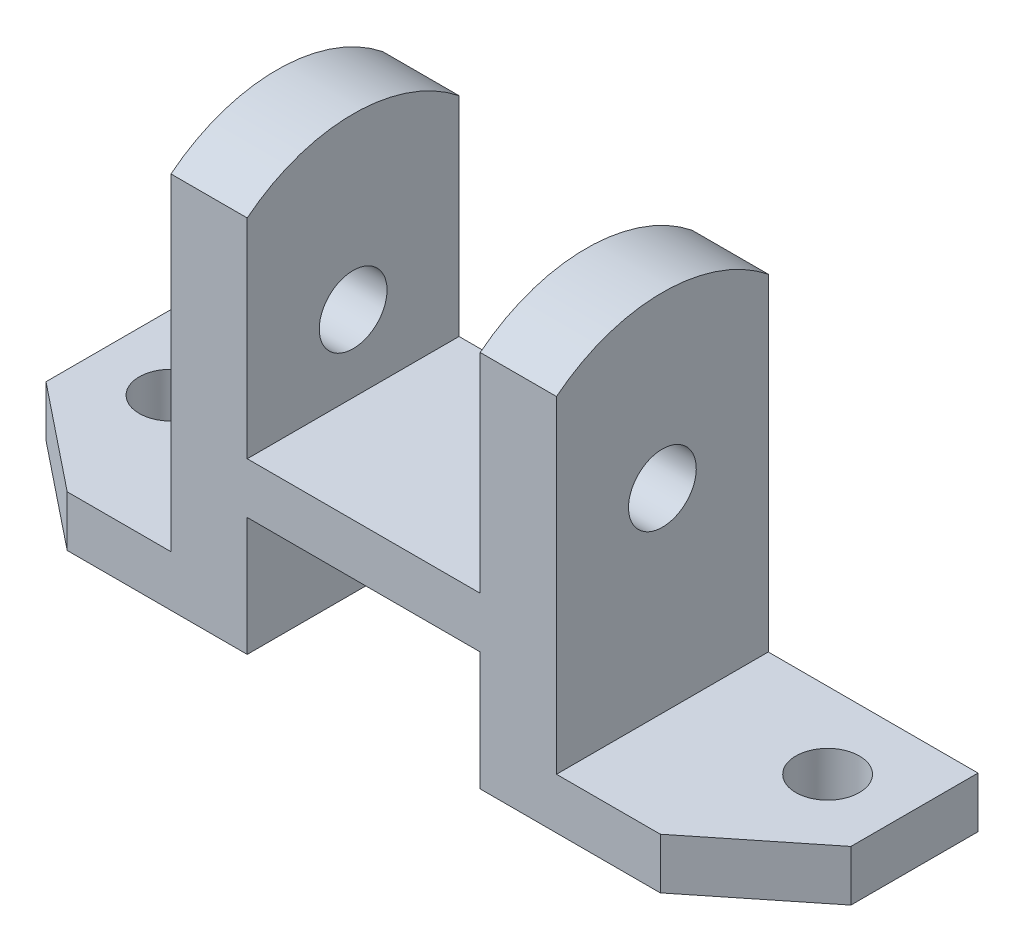
ISO-10303-21;
HEADER;
FILE_DESCRIPTION(('STEP AP214'),'2;1');
FILE_NAME('part.step','',(''),(''),'','','');
FILE_SCHEMA(('AUTOMOTIVE_DESIGN { 1 0 10303 214 1 1 1 1 }'));
ENDSEC;
DATA;
#1=APPLICATION_CONTEXT('core data for automotive mechanical design processes');
#2=APPLICATION_PROTOCOL_DEFINITION('international standard','automotive_design',2000,#1);
#3=PRODUCT_CONTEXT('',#1,'mechanical');
#4=PRODUCT('Part','Part','',(#3));
#5=PRODUCT_RELATED_PRODUCT_CATEGORY('part','',(#4));
#6=PRODUCT_DEFINITION_FORMATION('','',#4);
#7=PRODUCT_DEFINITION_CONTEXT('part definition',#1,'design');
#8=PRODUCT_DEFINITION('design','',#6,#7);
#9=PRODUCT_DEFINITION_SHAPE('','',#8);
#10=(LENGTH_UNIT() NAMED_UNIT(*) SI_UNIT(.MILLI.,.METRE.));
#11=(NAMED_UNIT(*) PLANE_ANGLE_UNIT() SI_UNIT($,.RADIAN.));
#12=(NAMED_UNIT(*) SI_UNIT($,.STERADIAN.) SOLID_ANGLE_UNIT());
#13=UNCERTAINTY_MEASURE_WITH_UNIT(LENGTH_MEASURE(1.E-05),#10,'distance_accuracy_value','');
#14=(GEOMETRIC_REPRESENTATION_CONTEXT(3) GLOBAL_UNCERTAINTY_ASSIGNED_CONTEXT((#13)) GLOBAL_UNIT_ASSIGNED_CONTEXT((#10,
#11,#12)) REPRESENTATION_CONTEXT('',''));
#15=CARTESIAN_POINT('',(0.,0.,0.));
#16=DIRECTION('',(0.,0.,1.));
#17=DIRECTION('',(1.,0.,0.));
#18=AXIS2_PLACEMENT_3D('',#15,#16,#17);
#19=CARTESIAN_POINT('',(45.5,98.,-25.));
#20=DIRECTION('',(-1.,0.,0.));
#21=DIRECTION('',(0.,-1.,0.));
#22=AXIS2_PLACEMENT_3D('',#19,#20,#21);
#23=PLANE('',#22);
#24=CARTESIAN_POINT('',(45.5,58.,0.));
#25=DIRECTION('',(1.,0.,0.));
#26=DIRECTION('',(0.,1.,0.));
#27=AXIS2_PLACEMENT_3D('',#24,#25,#26);
#28=CIRCLE('',#27,8.);
#29=CARTESIAN_POINT('',(45.5,66.,0.));
#30=VERTEX_POINT('',#29);
#31=EDGE_CURVE('E211',#30,#30,#28,.T.);
#32=ORIENTED_EDGE('',*,*,#31,.F.);
#33=EDGE_LOOP('',(#32));
#34=FACE_BOUND('',#33,.T.);
#35=CARTESIAN_POINT('',(45.5,58.,0.));
#36=DIRECTION('',(1.,0.,0.));
#37=DIRECTION('',(0.,1.,0.));
#38=AXIS2_PLACEMENT_3D('',#35,#36,#37);
#39=CIRCLE('',#38,40.);
#40=CARTESIAN_POINT('',(45.5,89.224989991992,-25.));
#41=VERTEX_POINT('',#40);
#42=CARTESIAN_POINT('',(45.5,89.224989991992,25.));
#43=VERTEX_POINT('',#42);
#44=EDGE_CURVE('E192',#41,#43,#39,.T.);
#45=ORIENTED_EDGE('',*,*,#44,.T.);
#46=DIRECTION('',(0.,-1.,0.));
#47=VECTOR('',#46,1.);
#48=CARTESIAN_POINT('',(45.5,98.,25.));
#49=LINE('',#48,#47);
#50=CARTESIAN_POINT('',(45.5,12.,25.));
#51=VERTEX_POINT('',#50);
#52=EDGE_CURVE('E196',#43,#51,#49,.T.);
#53=ORIENTED_EDGE('',*,*,#52,.T.);
#54=DIRECTION('',(0.,0.,1.));
#55=VECTOR('',#54,1.);
#56=CARTESIAN_POINT('',(45.5,12.,-25.));
#57=LINE('',#56,#55);
#58=CARTESIAN_POINT('',(45.5,12.,-25.));
#59=VERTEX_POINT('',#58);
#60=EDGE_CURVE('E232',#59,#51,#57,.T.);
#61=ORIENTED_EDGE('',*,*,#60,.F.);
#62=DIRECTION('',(0.,-1.,0.));
#63=VECTOR('',#62,1.);
#64=CARTESIAN_POINT('',(45.5,98.,-25.));
#65=LINE('',#64,#63);
#66=EDGE_CURVE('E198',#41,#59,#65,.T.);
#67=ORIENTED_EDGE('',*,*,#66,.F.);
#68=EDGE_LOOP('',(#45,#53,#61,#67));
#69=FACE_BOUND('',#68,.T.);
#70=ADVANCED_FACE('F43',(#34,#69),#23,.F.);
#71=CARTESIAN_POINT('',(-27.5,98.,-25.));
#72=DIRECTION('',(-1.,0.,0.));
#73=DIRECTION('',(0.,-1.,0.));
#74=AXIS2_PLACEMENT_3D('',#71,#72,#73);
#75=PLANE('',#74);
#76=CARTESIAN_POINT('',(-27.5,58.,0.));
#77=DIRECTION('',(-1.,0.,0.));
#78=DIRECTION('',(0.,-1.,0.));
#79=AXIS2_PLACEMENT_3D('',#76,#77,#78);
#80=CIRCLE('',#79,8.);
#81=CARTESIAN_POINT('',(-27.5,50.,0.));
#82=VERTEX_POINT('',#81);
#83=EDGE_CURVE('E200',#82,#82,#80,.T.);
#84=ORIENTED_EDGE('',*,*,#83,.T.);
#85=EDGE_LOOP('',(#84));
#86=FACE_BOUND('',#85,.T.);
#87=CARTESIAN_POINT('',(-27.5,58.,0.));
#88=DIRECTION('',(-1.,0.,0.));
#89=DIRECTION('',(0.,-1.,0.));
#90=AXIS2_PLACEMENT_3D('',#87,#88,#89);
#91=CIRCLE('',#90,40.);
#92=CARTESIAN_POINT('',(-27.5,89.224989991992,25.));
#93=VERTEX_POINT('',#92);
#94=CARTESIAN_POINT('',(-27.5,89.224989991992,-25.));
#95=VERTEX_POINT('',#94);
#96=EDGE_CURVE('E398',#93,#95,#91,.T.);
#97=ORIENTED_EDGE('',*,*,#96,.F.);
#98=DIRECTION('',(0.,-1.,0.));
#99=VECTOR('',#98,1.);
#100=CARTESIAN_POINT('',(-27.5,98.,25.));
#101=LINE('',#100,#99);
#102=CARTESIAN_POINT('',(-27.5,40.,25.));
#103=VERTEX_POINT('',#102);
#104=EDGE_CURVE('E332',#93,#103,#101,.T.);
#105=ORIENTED_EDGE('',*,*,#104,.T.);
#106=DIRECTION('',(0.,0.,1.));
#107=VECTOR('',#106,1.);
#108=CARTESIAN_POINT('',(-27.5,40.,-25.));
#109=LINE('',#108,#107);
#110=CARTESIAN_POINT('',(-27.5,40.,-25.));
#111=VERTEX_POINT('',#110);
#112=EDGE_CURVE('E223',#111,#103,#109,.T.);
#113=ORIENTED_EDGE('',*,*,#112,.F.);
#114=DIRECTION('',(0.,-1.,0.));
#115=VECTOR('',#114,1.);
#116=CARTESIAN_POINT('',(-27.5,98.,-25.));
#117=LINE('',#116,#115);
#118=EDGE_CURVE('E328',#95,#111,#117,.T.);
#119=ORIENTED_EDGE('',*,*,#118,.F.);
#120=EDGE_LOOP('',(#97,#105,#113,#119));
#121=FACE_BOUND('',#120,.T.);
#122=ADVANCED_FACE('F517',(#86,#121),#75,.F.);
#123=CARTESIAN_POINT('',(27.5,98.,-25.));
#124=DIRECTION('',(1.,0.,0.));
#125=DIRECTION('',(0.,1.,0.));
#126=AXIS2_PLACEMENT_3D('',#123,#124,#125);
#127=PLANE('',#126);
#128=CARTESIAN_POINT('',(27.5,58.,0.));
#129=DIRECTION('',(1.,0.,0.));
#130=DIRECTION('',(0.,1.,0.));
#131=AXIS2_PLACEMENT_3D('',#128,#129,#130);
#132=CIRCLE('',#131,8.);
#133=CARTESIAN_POINT('',(27.5,66.,0.));
#134=VERTEX_POINT('',#133);
#135=EDGE_CURVE('E383',#134,#134,#132,.T.);
#136=ORIENTED_EDGE('',*,*,#135,.T.);
#137=EDGE_LOOP('',(#136));
#138=FACE_BOUND('',#137,.T.);
#139=DIRECTION('',(0.,1.,0.));
#140=VECTOR('',#139,1.);
#141=CARTESIAN_POINT('',(27.5,98.,25.));
#142=LINE('',#141,#140);
#143=CARTESIAN_POINT('',(27.5,40.,25.));
#144=VERTEX_POINT('',#143);
#145=CARTESIAN_POINT('',(27.5,89.224989991992,25.));
#146=VERTEX_POINT('',#145);
#147=EDGE_CURVE('E324',#144,#146,#142,.T.);
#148=ORIENTED_EDGE('',*,*,#147,.T.);
#149=CARTESIAN_POINT('',(27.5,58.,0.));
#150=DIRECTION('',(1.,0.,0.));
#151=DIRECTION('',(0.,1.,0.));
#152=AXIS2_PLACEMENT_3D('',#149,#150,#151);
#153=CIRCLE('',#152,40.);
#154=CARTESIAN_POINT('',(27.5,89.224989991992,-25.));
#155=VERTEX_POINT('',#154);
#156=EDGE_CURVE('E205',#155,#146,#153,.T.);
#157=ORIENTED_EDGE('',*,*,#156,.F.);
#158=DIRECTION('',(0.,1.,0.));
#159=VECTOR('',#158,1.);
#160=CARTESIAN_POINT('',(27.5,98.,-25.));
#161=LINE('',#160,#159);
#162=CARTESIAN_POINT('',(27.5,40.,-25.));
#163=VERTEX_POINT('',#162);
#164=EDGE_CURVE('E322',#163,#155,#161,.T.);
#165=ORIENTED_EDGE('',*,*,#164,.F.);
#166=DIRECTION('',(0.,0.,1.));
#167=VECTOR('',#166,1.);
#168=CARTESIAN_POINT('',(27.5,40.,-25.));
#169=LINE('',#168,#167);
#170=EDGE_CURVE('E219',#163,#144,#169,.T.);
#171=ORIENTED_EDGE('',*,*,#170,.T.);
#172=EDGE_LOOP('',(#148,#157,#165,#171));
#173=FACE_BOUND('',#172,.T.);
#174=ADVANCED_FACE('F523',(#138,#173),#127,.F.);
#175=CARTESIAN_POINT('',(-45.5,98.,-25.));
#176=DIRECTION('',(1.,0.,0.));
#177=DIRECTION('',(0.,1.,0.));
#178=AXIS2_PLACEMENT_3D('',#175,#176,#177);
#179=PLANE('',#178);
#180=CARTESIAN_POINT('',(-45.5,58.,0.));
#181=DIRECTION('',(1.,0.,0.));
#182=DIRECTION('',(0.,1.,0.));
#183=AXIS2_PLACEMENT_3D('',#180,#181,#182);
#184=CIRCLE('',#183,8.);
#185=CARTESIAN_POINT('',(-45.5,66.,0.));
#186=VERTEX_POINT('',#185);
#187=EDGE_CURVE('E47',#186,#186,#184,.T.);
#188=ORIENTED_EDGE('',*,*,#187,.T.);
#189=EDGE_LOOP('',(#188));
#190=FACE_BOUND('',#189,.T.);
#191=DIRECTION('',(0.,1.,0.));
#192=VECTOR('',#191,1.);
#193=CARTESIAN_POINT('',(-45.5,98.,25.));
#194=LINE('',#193,#192);
#195=CARTESIAN_POINT('',(-45.5,12.,25.));
#196=VERTEX_POINT('',#195);
#197=CARTESIAN_POINT('',(-45.5,89.224989991992,25.));
#198=VERTEX_POINT('',#197);
#199=EDGE_CURVE('E317',#196,#198,#194,.T.);
#200=ORIENTED_EDGE('',*,*,#199,.T.);
#201=CARTESIAN_POINT('',(-45.5,58.,0.));
#202=DIRECTION('',(1.,0.,0.));
#203=DIRECTION('',(0.,1.,0.));
#204=AXIS2_PLACEMENT_3D('',#201,#202,#203);
#205=CIRCLE('',#204,40.);
#206=CARTESIAN_POINT('',(-45.5,89.224989991992,-25.));
#207=VERTEX_POINT('',#206);
#208=EDGE_CURVE('E11',#207,#198,#205,.T.);
#209=ORIENTED_EDGE('',*,*,#208,.F.);
#210=DIRECTION('',(0.,1.,0.));
#211=VECTOR('',#210,1.);
#212=CARTESIAN_POINT('',(-45.5,98.,-25.));
#213=LINE('',#212,#211);
#214=CARTESIAN_POINT('',(-45.5,12.,-25.));
#215=VERTEX_POINT('',#214);
#216=EDGE_CURVE('E314',#215,#207,#213,.T.);
#217=ORIENTED_EDGE('',*,*,#216,.F.);
#218=DIRECTION('',(0.,0.,1.));
#219=VECTOR('',#218,1.);
#220=CARTESIAN_POINT('',(-45.5,12.,-25.));
#221=LINE('',#220,#219);
#222=EDGE_CURVE('E302',#215,#196,#221,.T.);
#223=ORIENTED_EDGE('',*,*,#222,.T.);
#224=EDGE_LOOP('',(#200,#209,#217,#223));
#225=FACE_BOUND('',#224,.T.);
#226=ADVANCED_FACE('F375',(#190,#225),#179,.F.);
#227=CARTESIAN_POINT('',(0.,98.,25.));
#228=DIRECTION('',(0.,0.,-1.));
#229=DIRECTION('',(-1.,0.,0.));
#230=AXIS2_PLACEMENT_3D('',#227,#228,#229);
#231=PLANE('',#230);
#232=DIRECTION('',(1.,0.,0.));
#233=VECTOR('',#232,1.);
#234=CARTESIAN_POINT('',(-95.,89.224989991992,25.));
#235=LINE('',#234,#233);
#236=EDGE_CURVE('E210',#198,#93,#235,.T.);
#237=ORIENTED_EDGE('',*,*,#236,.F.);
#238=ORIENTED_EDGE('',*,*,#199,.F.);
#239=DIRECTION('',(1.,0.,0.));
#240=VECTOR('',#239,1.);
#241=CARTESIAN_POINT('',(-95.,12.,25.));
#242=LINE('',#241,#240);
#243=CARTESIAN_POINT('',(-70.,12.,25.));
#244=VERTEX_POINT('',#243);
#245=EDGE_CURVE('E335',#244,#196,#242,.T.);
#246=ORIENTED_EDGE('',*,*,#245,.F.);
#247=DIRECTION('',(0.,-1.,0.));
#248=VECTOR('',#247,1.);
#249=CARTESIAN_POINT('',(-70.,98.,25.));
#250=LINE('',#249,#248);
#251=CARTESIAN_POINT('',(-70.,0.,25.));
#252=VERTEX_POINT('',#251);
#253=EDGE_CURVE('E285',#244,#252,#250,.T.);
#254=ORIENTED_EDGE('',*,*,#253,.T.);
#255=DIRECTION('',(1.,0.,0.));
#256=VECTOR('',#255,1.);
#257=CARTESIAN_POINT('',(0.,0.,25.));
#258=LINE('',#257,#256);
#259=CARTESIAN_POINT('',(-27.5,0.,25.));
#260=VERTEX_POINT('',#259);
#261=EDGE_CURVE('E269',#252,#260,#258,.T.);
#262=ORIENTED_EDGE('',*,*,#261,.T.);
#263=DIRECTION('',(0.,1.,0.));
#264=VECTOR('',#263,1.);
#265=CARTESIAN_POINT('',(-27.5,0.,25.));
#266=LINE('',#265,#264);
#267=CARTESIAN_POINT('',(-27.5,28.,25.));
#268=VERTEX_POINT('',#267);
#269=EDGE_CURVE('E432',#260,#268,#266,.T.);
#270=ORIENTED_EDGE('',*,*,#269,.T.);
#271=DIRECTION('',(1.,0.,0.));
#272=VECTOR('',#271,1.);
#273=CARTESIAN_POINT('',(-27.5,28.,25.));
#274=LINE('',#273,#272);
#275=CARTESIAN_POINT('',(27.5,28.,25.));
#276=VERTEX_POINT('',#275);
#277=EDGE_CURVE('E405',#268,#276,#274,.T.);
#278=ORIENTED_EDGE('',*,*,#277,.T.);
#279=DIRECTION('',(0.,1.,0.));
#280=VECTOR('',#279,1.);
#281=CARTESIAN_POINT('',(27.5,0.,25.));
#282=LINE('',#281,#280);
#283=CARTESIAN_POINT('',(27.5,0.,25.));
#284=VERTEX_POINT('',#283);
#285=EDGE_CURVE('E443',#284,#276,#282,.T.);
#286=ORIENTED_EDGE('',*,*,#285,.F.);
#287=CARTESIAN_POINT('',(70.,0.,25.));
#288=VERTEX_POINT('',#287);
#289=EDGE_CURVE('E268',#284,#288,#258,.T.);
#290=ORIENTED_EDGE('',*,*,#289,.T.);
#291=DIRECTION('',(0.,-1.,0.));
#292=VECTOR('',#291,1.);
#293=CARTESIAN_POINT('',(70.,98.,25.));
#294=LINE('',#293,#292);
#295=CARTESIAN_POINT('',(70.,12.,25.));
#296=VERTEX_POINT('',#295);
#297=EDGE_CURVE('E281',#296,#288,#294,.T.);
#298=ORIENTED_EDGE('',*,*,#297,.F.);
#299=DIRECTION('',(1.,0.,0.));
#300=VECTOR('',#299,1.);
#301=CARTESIAN_POINT('',(95.,12.,25.));
#302=LINE('',#301,#300);
#303=EDGE_CURVE('E217',#51,#296,#302,.T.);
#304=ORIENTED_EDGE('',*,*,#303,.F.);
#305=ORIENTED_EDGE('',*,*,#52,.F.);
#306=EDGE_CURVE('E203',#146,#43,#235,.T.);
#307=ORIENTED_EDGE('',*,*,#306,.F.);
#308=ORIENTED_EDGE('',*,*,#147,.F.);
#309=DIRECTION('',(1.,0.,0.));
#310=VECTOR('',#309,1.);
#311=CARTESIAN_POINT('',(-27.5,40.,25.));
#312=LINE('',#311,#310);
#313=EDGE_CURVE('E327',#103,#144,#312,.T.);
#314=ORIENTED_EDGE('',*,*,#313,.F.);
#315=ORIENTED_EDGE('',*,*,#104,.F.);
#316=EDGE_LOOP('',(#237,#238,#246,#254,#262,#270,#278,#286,#290,#298,#304,#305,#307,#308,#314,#315));
#317=FACE_BOUND('',#316,.T.);
#318=ADVANCED_FACE('F215',(#317),#231,.F.);
#319=CARTESIAN_POINT('',(0.,98.,-25.));
#320=DIRECTION('',(0.,0.,-1.));
#321=DIRECTION('',(-1.,0.,0.));
#322=AXIS2_PLACEMENT_3D('',#319,#320,#321);
#323=PLANE('',#322);
#324=ORIENTED_EDGE('',*,*,#216,.T.);
#325=DIRECTION('',(1.,0.,0.));
#326=VECTOR('',#325,1.);
#327=CARTESIAN_POINT('',(-95.,89.224989991992,-25.));
#328=LINE('',#327,#326);
#329=EDGE_CURVE('E67',#207,#95,#328,.T.);
#330=ORIENTED_EDGE('',*,*,#329,.T.);
#331=ORIENTED_EDGE('',*,*,#118,.T.);
#332=DIRECTION('',(1.,0.,0.));
#333=VECTOR('',#332,1.);
#334=CARTESIAN_POINT('',(-27.5,40.,-25.));
#335=LINE('',#334,#333);
#336=EDGE_CURVE('E339',#111,#163,#335,.T.);
#337=ORIENTED_EDGE('',*,*,#336,.T.);
#338=ORIENTED_EDGE('',*,*,#164,.T.);
#339=EDGE_CURVE('E60',#155,#41,#328,.T.);
#340=ORIENTED_EDGE('',*,*,#339,.T.);
#341=ORIENTED_EDGE('',*,*,#66,.T.);
#342=DIRECTION('',(1.,0.,0.));
#343=VECTOR('',#342,1.);
#344=CARTESIAN_POINT('',(95.,12.,-25.));
#345=LINE('',#344,#343);
#346=CARTESIAN_POINT('',(95.,12.,-25.));
#347=VERTEX_POINT('',#346);
#348=EDGE_CURVE('E228',#59,#347,#345,.T.);
#349=ORIENTED_EDGE('',*,*,#348,.T.);
#350=DIRECTION('',(0.,-1.,0.));
#351=VECTOR('',#350,1.);
#352=CARTESIAN_POINT('',(95.,98.,-25.));
#353=LINE('',#352,#351);
#354=CARTESIAN_POINT('',(95.,0.,-25.));
#355=VERTEX_POINT('',#354);
#356=EDGE_CURVE('E294',#347,#355,#353,.T.);
#357=ORIENTED_EDGE('',*,*,#356,.T.);
#358=DIRECTION('',(1.,0.,0.));
#359=VECTOR('',#358,1.);
#360=CARTESIAN_POINT('',(0.,0.,-25.));
#361=LINE('',#360,#359);
#362=CARTESIAN_POINT('',(27.5,0.,-25.));
#363=VERTEX_POINT('',#362);
#364=EDGE_CURVE('E255',#363,#355,#361,.T.);
#365=ORIENTED_EDGE('',*,*,#364,.F.);
#366=DIRECTION('',(0.,1.,0.));
#367=VECTOR('',#366,1.);
#368=CARTESIAN_POINT('',(27.5,0.,-25.));
#369=LINE('',#368,#367);
#370=CARTESIAN_POINT('',(27.5,28.,-25.));
#371=VERTEX_POINT('',#370);
#372=EDGE_CURVE('E431',#363,#371,#369,.T.);
#373=ORIENTED_EDGE('',*,*,#372,.T.);
#374=DIRECTION('',(1.,0.,0.));
#375=VECTOR('',#374,1.);
#376=CARTESIAN_POINT('',(-27.5,28.,-25.));
#377=LINE('',#376,#375);
#378=CARTESIAN_POINT('',(-27.5,28.,-25.));
#379=VERTEX_POINT('',#378);
#380=EDGE_CURVE('E428',#379,#371,#377,.T.);
#381=ORIENTED_EDGE('',*,*,#380,.F.);
#382=DIRECTION('',(0.,1.,0.));
#383=VECTOR('',#382,1.);
#384=CARTESIAN_POINT('',(-27.5,0.,-25.));
#385=LINE('',#384,#383);
#386=CARTESIAN_POINT('',(-27.5,0.,-25.));
#387=VERTEX_POINT('',#386);
#388=EDGE_CURVE('E436',#387,#379,#385,.T.);
#389=ORIENTED_EDGE('',*,*,#388,.F.);
#390=CARTESIAN_POINT('',(-95.,0.,-25.));
#391=VERTEX_POINT('',#390);
#392=EDGE_CURVE('E256',#391,#387,#361,.T.);
#393=ORIENTED_EDGE('',*,*,#392,.F.);
#394=DIRECTION('',(0.,-1.,0.));
#395=VECTOR('',#394,1.);
#396=CARTESIAN_POINT('',(-95.,98.,-25.));
#397=LINE('',#396,#395);
#398=CARTESIAN_POINT('',(-95.,12.,-25.));
#399=VERTEX_POINT('',#398);
#400=EDGE_CURVE('E291',#399,#391,#397,.T.);
#401=ORIENTED_EDGE('',*,*,#400,.F.);
#402=DIRECTION('',(1.,0.,0.));
#403=VECTOR('',#402,1.);
#404=CARTESIAN_POINT('',(-95.,12.,-25.));
#405=LINE('',#404,#403);
#406=EDGE_CURVE('E365',#399,#215,#405,.T.);
#407=ORIENTED_EDGE('',*,*,#406,.T.);
#408=EDGE_LOOP('',(#324,#330,#331,#337,#338,#340,#341,#349,#357,#365,#373,#381,#389,#393,#401,#407));
#409=FACE_BOUND('',#408,.T.);
#410=ADVANCED_FACE('F485',(#409),#323,.T.);
#411=CARTESIAN_POINT('',(-27.5,28.,-25.));
#412=DIRECTION('',(0.,-1.,0.));
#413=DIRECTION('',(0.,0.,-1.));
#414=AXIS2_PLACEMENT_3D('',#411,#412,#413);
#415=PLANE('',#414);
#416=DIRECTION('',(0.,0.,1.));
#417=VECTOR('',#416,1.);
#418=CARTESIAN_POINT('',(27.5,28.,-25.));
#419=LINE('',#418,#417);
#420=CARTESIAN_POINT('',(27.5,28.,-11.));
#421=VERTEX_POINT('',#420);
#422=EDGE_CURVE('E349',#371,#421,#419,.T.);
#423=ORIENTED_EDGE('',*,*,#422,.T.);
#424=DIRECTION('',(1.,0.,0.));
#425=VECTOR('',#424,1.);
#426=CARTESIAN_POINT('',(-27.5,28.,-11.));
#427=LINE('',#426,#425);
#428=CARTESIAN_POINT('',(-27.5,28.,-11.));
#429=VERTEX_POINT('',#428);
#430=EDGE_CURVE('E409',#429,#421,#427,.T.);
#431=ORIENTED_EDGE('',*,*,#430,.F.);
#432=DIRECTION('',(0.,0.,1.));
#433=VECTOR('',#432,1.);
#434=CARTESIAN_POINT('',(-27.5,28.,-25.));
#435=LINE('',#434,#433);
#436=EDGE_CURVE('E450',#379,#429,#435,.T.);
#437=ORIENTED_EDGE('',*,*,#436,.F.);
#438=ORIENTED_EDGE('',*,*,#380,.T.);
#439=EDGE_LOOP('',(#423,#431,#437,#438));
#440=FACE_BOUND('',#439,.T.);
#441=ADVANCED_FACE('F491',(#440),#415,.T.);
#442=CARTESIAN_POINT('',(-27.5,28.,-3.00000000000001));
#443=VERTEX_POINT('',#442);
#444=EDGE_CURVE('E439',#443,#268,#435,.T.);
#445=ORIENTED_EDGE('',*,*,#444,.F.);
#446=DIRECTION('',(-1.,0.,0.));
#447=VECTOR('',#446,1.);
#448=CARTESIAN_POINT('',(-27.5,28.,-3.00000000000001));
#449=LINE('',#448,#447);
#450=CARTESIAN_POINT('',(27.5,28.,-3.00000000000001));
#451=VERTEX_POINT('',#450);
#452=EDGE_CURVE('E401',#451,#443,#449,.T.);
#453=ORIENTED_EDGE('',*,*,#452,.F.);
#454=EDGE_CURVE('E355',#451,#276,#419,.T.);
#455=ORIENTED_EDGE('',*,*,#454,.T.);
#456=ORIENTED_EDGE('',*,*,#277,.F.);
#457=EDGE_LOOP('',(#445,#453,#455,#456));
#458=FACE_BOUND('',#457,.T.);
#459=ADVANCED_FACE('F551',(#458),#415,.T.);
#460=CARTESIAN_POINT('',(27.5,0.,-25.));
#461=DIRECTION('',(1.,0.,0.));
#462=DIRECTION('',(0.,1.,0.));
#463=AXIS2_PLACEMENT_3D('',#460,#461,#462);
#464=PLANE('',#463);
#465=DIRECTION('',(0.,1.,0.));
#466=VECTOR('',#465,1.);
#467=CARTESIAN_POINT('',(27.5,-55.578772926361,-11.));
#468=LINE('',#467,#466);
#469=CARTESIAN_POINT('',(27.5,0.,-11.));
#470=VERTEX_POINT('',#469);
#471=EDGE_CURVE('E412',#470,#421,#468,.T.);
#472=ORIENTED_EDGE('',*,*,#471,.T.);
#473=ORIENTED_EDGE('',*,*,#422,.F.);
#474=ORIENTED_EDGE('',*,*,#372,.F.);
#475=DIRECTION('',(0.,0.,1.));
#476=VECTOR('',#475,1.);
#477=CARTESIAN_POINT('',(27.5,0.,-25.));
#478=LINE('',#477,#476);
#479=EDGE_CURVE('E361',#363,#470,#478,.T.);
#480=ORIENTED_EDGE('',*,*,#479,.T.);
#481=EDGE_LOOP('',(#472,#473,#474,#480));
#482=FACE_BOUND('',#481,.T.);
#483=ADVANCED_FACE('F497',(#482),#464,.F.);
#484=DIRECTION('',(0.,1.,0.));
#485=VECTOR('',#484,1.);
#486=CARTESIAN_POINT('',(27.5,-55.578772926361,-3.00000000000001));
#487=LINE('',#486,#485);
#488=CARTESIAN_POINT('',(27.5,0.,-3.00000000000001));
#489=VERTEX_POINT('',#488);
#490=EDGE_CURVE('E423',#489,#451,#487,.T.);
#491=ORIENTED_EDGE('',*,*,#490,.F.);
#492=EDGE_CURVE('E457',#489,#284,#478,.T.);
#493=ORIENTED_EDGE('',*,*,#492,.T.);
#494=ORIENTED_EDGE('',*,*,#285,.T.);
#495=ORIENTED_EDGE('',*,*,#454,.F.);
#496=EDGE_LOOP('',(#491,#493,#494,#495));
#497=FACE_BOUND('',#496,.T.);
#498=ADVANCED_FACE('F591',(#497),#464,.F.);
#499=CARTESIAN_POINT('',(-27.5,0.,-25.));
#500=DIRECTION('',(1.,0.,0.));
#501=DIRECTION('',(0.,1.,0.));
#502=AXIS2_PLACEMENT_3D('',#499,#500,#501);
#503=PLANE('',#502);
#504=ORIENTED_EDGE('',*,*,#436,.T.);
#505=DIRECTION('',(0.,1.,0.));
#506=VECTOR('',#505,1.);
#507=CARTESIAN_POINT('',(-27.5,-55.578772926361,-11.));
#508=LINE('',#507,#506);
#509=CARTESIAN_POINT('',(-27.5,0.,-11.));
#510=VERTEX_POINT('',#509);
#511=EDGE_CURVE('E416',#510,#429,#508,.T.);
#512=ORIENTED_EDGE('',*,*,#511,.F.);
#513=DIRECTION('',(0.,0.,1.));
#514=VECTOR('',#513,1.);
#515=CARTESIAN_POINT('',(-27.5,0.,-25.));
#516=LINE('',#515,#514);
#517=EDGE_CURVE('E454',#387,#510,#516,.T.);
#518=ORIENTED_EDGE('',*,*,#517,.F.);
#519=ORIENTED_EDGE('',*,*,#388,.T.);
#520=EDGE_LOOP('',(#504,#512,#518,#519));
#521=FACE_BOUND('',#520,.T.);
#522=ADVANCED_FACE('F489',(#521),#503,.T.);
#523=CARTESIAN_POINT('',(-27.5,0.,-3.00000000000001));
#524=VERTEX_POINT('',#523);
#525=EDGE_CURVE('E453',#524,#260,#516,.T.);
#526=ORIENTED_EDGE('',*,*,#525,.F.);
#527=DIRECTION('',(0.,1.,0.));
#528=VECTOR('',#527,1.);
#529=CARTESIAN_POINT('',(-27.5,-55.578772926361,-3.00000000000001));
#530=LINE('',#529,#528);
#531=EDGE_CURVE('E419',#524,#443,#530,.T.);
#532=ORIENTED_EDGE('',*,*,#531,.T.);
#533=ORIENTED_EDGE('',*,*,#444,.T.);
#534=ORIENTED_EDGE('',*,*,#269,.F.);
#535=EDGE_LOOP('',(#526,#532,#533,#534));
#536=FACE_BOUND('',#535,.T.);
#537=ADVANCED_FACE('F471',(#536),#503,.T.);
#538=CARTESIAN_POINT('',(39.5121951219513,98.,49.390243902439));
#539=DIRECTION('',(0.624695047554425,0.,0.78086880944303));
#540=DIRECTION('',(0.78086880944303,0.,-0.624695047554425));
#541=AXIS2_PLACEMENT_3D('',#538,#539,#540);
#542=PLANE('',#541);
#543=DIRECTION('',(0.78086880944303,0.,-0.624695047554425));
#544=VECTOR('',#543,1.);
#545=CARTESIAN_POINT('',(39.5121951219513,12.,49.390243902439));
#546=LINE('',#545,#544);
#547=CARTESIAN_POINT('',(95.,12.,4.99999999999997));
#548=VERTEX_POINT('',#547);
#549=EDGE_CURVE('E235',#296,#548,#546,.T.);
#550=ORIENTED_EDGE('',*,*,#549,.F.);
#551=ORIENTED_EDGE('',*,*,#297,.T.);
#552=DIRECTION('',(-0.78086880944303,0.,0.624695047554425));
#553=VECTOR('',#552,1.);
#554=CARTESIAN_POINT('',(39.5121951219513,0.,49.390243902439));
#555=LINE('',#554,#553);
#556=CARTESIAN_POINT('',(95.,0.,4.99999999999997));
#557=VERTEX_POINT('',#556);
#558=EDGE_CURVE('E247',#557,#288,#555,.T.);
#559=ORIENTED_EDGE('',*,*,#558,.F.);
#560=DIRECTION('',(0.,-1.,0.));
#561=VECTOR('',#560,1.);
#562=CARTESIAN_POINT('',(95.,98.,4.99999999999997));
#563=LINE('',#562,#561);
#564=EDGE_CURVE('E53',#548,#557,#563,.T.);
#565=ORIENTED_EDGE('',*,*,#564,.F.);
#566=EDGE_LOOP('',(#550,#551,#559,#565));
#567=FACE_BOUND('',#566,.T.);
#568=ADVANCED_FACE('F45',(#567),#542,.T.);
#569=CARTESIAN_POINT('',(95.,98.,0.));
#570=DIRECTION('',(-1.,0.,0.));
#571=DIRECTION('',(0.,0.,1.));
#572=AXIS2_PLACEMENT_3D('',#569,#570,#571);
#573=PLANE('',#572);
#574=ORIENTED_EDGE('',*,*,#356,.F.);
#575=DIRECTION('',(0.,0.,1.));
#576=VECTOR('',#575,1.);
#577=CARTESIAN_POINT('',(95.,12.,-25.));
#578=LINE('',#577,#576);
#579=EDGE_CURVE('E346',#347,#548,#578,.T.);
#580=ORIENTED_EDGE('',*,*,#579,.T.);
#581=ORIENTED_EDGE('',*,*,#564,.T.);
#582=DIRECTION('',(0.,0.,-1.));
#583=VECTOR('',#582,1.);
#584=CARTESIAN_POINT('',(95.,0.,0.));
#585=LINE('',#584,#583);
#586=EDGE_CURVE('E251',#557,#355,#585,.T.);
#587=ORIENTED_EDGE('',*,*,#586,.T.);
#588=EDGE_LOOP('',(#574,#580,#581,#587));
#589=FACE_BOUND('',#588,.T.);
#590=ADVANCED_FACE('F508',(#589),#573,.F.);
#591=CARTESIAN_POINT('',(-95.,98.,0.));
#592=DIRECTION('',(-1.,0.,0.));
#593=DIRECTION('',(0.,0.,1.));
#594=AXIS2_PLACEMENT_3D('',#591,#592,#593);
#595=PLANE('',#594);
#596=DIRECTION('',(0.,0.,1.));
#597=VECTOR('',#596,1.);
#598=CARTESIAN_POINT('',(-95.,12.,-25.));
#599=LINE('',#598,#597);
#600=CARTESIAN_POINT('',(-95.,12.,4.99999999999999));
#601=VERTEX_POINT('',#600);
#602=EDGE_CURVE('E307',#399,#601,#599,.T.);
#603=ORIENTED_EDGE('',*,*,#602,.F.);
#604=ORIENTED_EDGE('',*,*,#400,.T.);
#605=DIRECTION('',(0.,0.,-1.));
#606=VECTOR('',#605,1.);
#607=CARTESIAN_POINT('',(-95.,0.,0.));
#608=LINE('',#607,#606);
#609=CARTESIAN_POINT('',(-95.,0.,5.));
#610=VERTEX_POINT('',#609);
#611=EDGE_CURVE('E260',#610,#391,#608,.T.);
#612=ORIENTED_EDGE('',*,*,#611,.F.);
#613=DIRECTION('',(0.,-1.,0.));
#614=VECTOR('',#613,1.);
#615=CARTESIAN_POINT('',(-95.,98.,5.));
#616=LINE('',#615,#614);
#617=EDGE_CURVE('E288',#601,#610,#616,.T.);
#618=ORIENTED_EDGE('',*,*,#617,.F.);
#619=EDGE_LOOP('',(#603,#604,#612,#618));
#620=FACE_BOUND('',#619,.T.);
#621=ADVANCED_FACE('F480',(#620),#595,.T.);
#622=CARTESIAN_POINT('',(-39.5121951219512,98.,49.390243902439));
#623=DIRECTION('',(0.624695047554424,0.,-0.78086880944303));
#624=DIRECTION('',(-0.78086880944303,0.,-0.624695047554424));
#625=AXIS2_PLACEMENT_3D('',#622,#623,#624);
#626=PLANE('',#625);
#627=ORIENTED_EDGE('',*,*,#253,.F.);
#628=DIRECTION('',(-0.78086880944303,0.,-0.624695047554424));
#629=VECTOR('',#628,1.);
#630=CARTESIAN_POINT('',(-39.5121951219512,12.,49.390243902439));
#631=LINE('',#630,#629);
#632=EDGE_CURVE('E243',#244,#601,#631,.T.);
#633=ORIENTED_EDGE('',*,*,#632,.T.);
#634=ORIENTED_EDGE('',*,*,#617,.T.);
#635=DIRECTION('',(0.78086880944303,0.,0.624695047554424));
#636=VECTOR('',#635,1.);
#637=CARTESIAN_POINT('',(-39.5121951219512,0.,49.390243902439));
#638=LINE('',#637,#636);
#639=EDGE_CURVE('E264',#610,#252,#638,.T.);
#640=ORIENTED_EDGE('',*,*,#639,.T.);
#641=EDGE_LOOP('',(#627,#633,#634,#640));
#642=FACE_BOUND('',#641,.T.);
#643=ADVANCED_FACE('F475',(#642),#626,.F.);
#644=CARTESIAN_POINT('',(-77.5,98.,-7.));
#645=DIRECTION('',(0.,-1.,0.));
#646=DIRECTION('',(0.,0.,-1.));
#647=AXIS2_PLACEMENT_3D('',#644,#645,#646);
#648=CYLINDRICAL_SURFACE('',#647,7.50000000000001);
#649=CARTESIAN_POINT('',(-77.5,12.,-7.));
#650=DIRECTION('',(0.,-1.,0.));
#651=DIRECTION('',(1.,0.,0.));
#652=AXIS2_PLACEMENT_3D('',#649,#650,#651);
#653=CIRCLE('',#652,7.50000000000001);
#654=CARTESIAN_POINT('',(-70.,12.,-7.));
#655=VERTEX_POINT('',#654);
#656=EDGE_CURVE('E238',#655,#655,#653,.T.);
#657=ORIENTED_EDGE('',*,*,#656,.F.);
#658=EDGE_LOOP('',(#657));
#659=FACE_BOUND('',#658,.T.);
#660=CARTESIAN_POINT('',(-77.5,0.,-7.));
#661=DIRECTION('',(0.,1.,0.));
#662=DIRECTION('',(0.,0.,1.));
#663=AXIS2_PLACEMENT_3D('',#660,#661,#662);
#664=CIRCLE('',#663,7.50000000000001);
#665=CARTESIAN_POINT('',(-77.5,0.,0.500000000000013));
#666=VERTEX_POINT('',#665);
#667=EDGE_CURVE('E273',#666,#666,#664,.T.);
#668=ORIENTED_EDGE('',*,*,#667,.F.);
#669=EDGE_LOOP('',(#668));
#670=FACE_BOUND('',#669,.T.);
#671=ADVANCED_FACE('F540',(#659,#670),#648,.F.);
#672=CARTESIAN_POINT('',(77.5,98.,-7.00000000000002));
#673=DIRECTION('',(0.,-1.,0.));
#674=DIRECTION('',(0.,0.,-1.));
#675=AXIS2_PLACEMENT_3D('',#672,#673,#674);
#676=CYLINDRICAL_SURFACE('',#675,7.50000000000001);
#677=CARTESIAN_POINT('',(77.5,12.,-7.00000000000002));
#678=DIRECTION('',(0.,-1.,0.));
#679=DIRECTION('',(1.,0.,0.));
#680=AXIS2_PLACEMENT_3D('',#677,#678,#679);
#681=CIRCLE('',#680,7.50000000000001);
#682=CARTESIAN_POINT('',(85.,12.,-7.00000000000002));
#683=VERTEX_POINT('',#682);
#684=EDGE_CURVE('E239',#683,#683,#681,.F.);
#685=ORIENTED_EDGE('',*,*,#684,.T.);
#686=EDGE_LOOP('',(#685));
#687=FACE_BOUND('',#686,.T.);
#688=CARTESIAN_POINT('',(77.5,0.,-7.00000000000002));
#689=DIRECTION('',(0.,1.,0.));
#690=DIRECTION('',(0.,0.,1.));
#691=AXIS2_PLACEMENT_3D('',#688,#689,#690);
#692=CIRCLE('',#691,7.50000000000001);
#693=CARTESIAN_POINT('',(77.5,0.,0.499999999999994));
#694=VERTEX_POINT('',#693);
#695=EDGE_CURVE('E277',#694,#694,#692,.F.);
#696=ORIENTED_EDGE('',*,*,#695,.T.);
#697=EDGE_LOOP('',(#696));
#698=FACE_BOUND('',#697,.T.);
#699=ADVANCED_FACE('F537',(#687,#698),#676,.F.);
#700=CARTESIAN_POINT('',(0.,0.,0.));
#701=DIRECTION('',(0.,1.,0.));
#702=DIRECTION('',(0.,0.,1.));
#703=AXIS2_PLACEMENT_3D('',#700,#701,#702);
#704=PLANE('',#703);
#705=ORIENTED_EDGE('',*,*,#289,.F.);
#706=ORIENTED_EDGE('',*,*,#492,.F.);
#707=DIRECTION('',(1.,0.,0.));
#708=VECTOR('',#707,1.);
#709=CARTESIAN_POINT('',(-27.5,0.,-3.00000000000001));
#710=LINE('',#709,#708);
#711=EDGE_CURVE('E402',#524,#489,#710,.T.);
#712=ORIENTED_EDGE('',*,*,#711,.F.);
#713=ORIENTED_EDGE('',*,*,#525,.T.);
#714=ORIENTED_EDGE('',*,*,#261,.F.);
#715=ORIENTED_EDGE('',*,*,#639,.F.);
#716=ORIENTED_EDGE('',*,*,#611,.T.);
#717=ORIENTED_EDGE('',*,*,#392,.T.);
#718=ORIENTED_EDGE('',*,*,#517,.T.);
#719=DIRECTION('',(-1.,0.,0.));
#720=VECTOR('',#719,1.);
#721=CARTESIAN_POINT('',(-27.5,0.,-11.));
#722=LINE('',#721,#720);
#723=EDGE_CURVE('E406',#470,#510,#722,.T.);
#724=ORIENTED_EDGE('',*,*,#723,.F.);
#725=ORIENTED_EDGE('',*,*,#479,.F.);
#726=ORIENTED_EDGE('',*,*,#364,.T.);
#727=ORIENTED_EDGE('',*,*,#586,.F.);
#728=ORIENTED_EDGE('',*,*,#558,.T.);
#729=EDGE_LOOP('',(#705,#706,#712,#713,#714,#715,#716,#717,#718,#724,#725,#726,#727,#728));
#730=FACE_BOUND('',#729,.T.);
#731=ORIENTED_EDGE('',*,*,#695,.F.);
#732=EDGE_LOOP('',(#731));
#733=FACE_BOUND('',#732,.T.);
#734=ORIENTED_EDGE('',*,*,#667,.T.);
#735=EDGE_LOOP('',(#734));
#736=FACE_BOUND('',#735,.T.);
#737=ADVANCED_FACE('F466',(#730,#733,#736),#704,.F.);
#738=CARTESIAN_POINT('',(95.,12.,-25.));
#739=DIRECTION('',(0.,-1.,0.));
#740=DIRECTION('',(1.,0.,0.));
#741=AXIS2_PLACEMENT_3D('',#738,#739,#740);
#742=PLANE('',#741);
#743=ORIENTED_EDGE('',*,*,#549,.T.);
#744=ORIENTED_EDGE('',*,*,#579,.F.);
#745=ORIENTED_EDGE('',*,*,#348,.F.);
#746=ORIENTED_EDGE('',*,*,#60,.T.);
#747=ORIENTED_EDGE('',*,*,#303,.T.);
#748=EDGE_LOOP('',(#743,#744,#745,#746,#747));
#749=FACE_BOUND('',#748,.T.);
#750=ORIENTED_EDGE('',*,*,#684,.F.);
#751=EDGE_LOOP('',(#750));
#752=FACE_BOUND('',#751,.T.);
#753=ADVANCED_FACE('F530',(#749,#752),#742,.F.);
#754=CARTESIAN_POINT('',(-27.5,40.,-25.));
#755=DIRECTION('',(0.,-1.,0.));
#756=DIRECTION('',(1.,0.,0.));
#757=AXIS2_PLACEMENT_3D('',#754,#755,#756);
#758=PLANE('',#757);
#759=ORIENTED_EDGE('',*,*,#313,.T.);
#760=ORIENTED_EDGE('',*,*,#170,.F.);
#761=ORIENTED_EDGE('',*,*,#336,.F.);
#762=ORIENTED_EDGE('',*,*,#112,.T.);
#763=EDGE_LOOP('',(#759,#760,#761,#762));
#764=FACE_BOUND('',#763,.T.);
#765=ADVANCED_FACE('F533',(#764),#758,.F.);
#766=CARTESIAN_POINT('',(-95.,12.,-25.));
#767=DIRECTION('',(0.,-1.,0.));
#768=DIRECTION('',(1.,0.,0.));
#769=AXIS2_PLACEMENT_3D('',#766,#767,#768);
#770=PLANE('',#769);
#771=ORIENTED_EDGE('',*,*,#656,.T.);
#772=EDGE_LOOP('',(#771));
#773=FACE_BOUND('',#772,.T.);
#774=ORIENTED_EDGE('',*,*,#245,.T.);
#775=ORIENTED_EDGE('',*,*,#222,.F.);
#776=ORIENTED_EDGE('',*,*,#406,.F.);
#777=ORIENTED_EDGE('',*,*,#602,.T.);
#778=ORIENTED_EDGE('',*,*,#632,.F.);
#779=EDGE_LOOP('',(#774,#775,#776,#777,#778));
#780=FACE_BOUND('',#779,.T.);
#781=ADVANCED_FACE('F563',(#773,#780),#770,.F.);
#782=CARTESIAN_POINT('',(-27.5,-55.578772926361,-11.));
#783=DIRECTION('',(0.,0.,1.));
#784=DIRECTION('',(1.,0.,0.));
#785=AXIS2_PLACEMENT_3D('',#782,#783,#784);
#786=PLANE('',#785);
#787=ORIENTED_EDGE('',*,*,#471,.F.);
#788=ORIENTED_EDGE('',*,*,#723,.T.);
#789=ORIENTED_EDGE('',*,*,#511,.T.);
#790=ORIENTED_EDGE('',*,*,#430,.T.);
#791=EDGE_LOOP('',(#787,#788,#789,#790));
#792=FACE_BOUND('',#791,.T.);
#793=ADVANCED_FACE('F494',(#792),#786,.F.);
#794=CARTESIAN_POINT('',(-27.5,-55.578772926361,-3.00000000000001));
#795=DIRECTION('',(0.,0.,-1.));
#796=DIRECTION('',(-1.,0.,0.));
#797=AXIS2_PLACEMENT_3D('',#794,#795,#796);
#798=PLANE('',#797);
#799=ORIENTED_EDGE('',*,*,#531,.F.);
#800=ORIENTED_EDGE('',*,*,#711,.T.);
#801=ORIENTED_EDGE('',*,*,#490,.T.);
#802=ORIENTED_EDGE('',*,*,#452,.T.);
#803=EDGE_LOOP('',(#799,#800,#801,#802));
#804=FACE_BOUND('',#803,.T.);
#805=ADVANCED_FACE('F578',(#804),#798,.F.);
#806=CARTESIAN_POINT('',(-95.,58.,0.));
#807=DIRECTION('',(1.,0.,0.));
#808=DIRECTION('',(0.,1.,0.));
#809=AXIS2_PLACEMENT_3D('',#806,#807,#808);
#810=CYLINDRICAL_SURFACE('',#809,40.);
#811=ORIENTED_EDGE('',*,*,#96,.T.);
#812=ORIENTED_EDGE('',*,*,#329,.F.);
#813=ORIENTED_EDGE('',*,*,#208,.T.);
#814=ORIENTED_EDGE('',*,*,#236,.T.);
#815=EDGE_LOOP('',(#811,#812,#813,#814));
#816=FACE_BOUND('',#815,.T.);
#817=ADVANCED_FACE('F576',(#816),#810,.T.);
#818=ORIENTED_EDGE('',*,*,#156,.T.);
#819=ORIENTED_EDGE('',*,*,#306,.T.);
#820=ORIENTED_EDGE('',*,*,#44,.F.);
#821=ORIENTED_EDGE('',*,*,#339,.F.);
#822=EDGE_LOOP('',(#818,#819,#820,#821));
#823=FACE_BOUND('',#822,.T.);
#824=ADVANCED_FACE('F204',(#823),#810,.T.);
#825=CARTESIAN_POINT('',(-95.,58.,0.));
#826=DIRECTION('',(1.,0.,0.));
#827=DIRECTION('',(0.,1.,0.));
#828=AXIS2_PLACEMENT_3D('',#825,#826,#827);
#829=CYLINDRICAL_SURFACE('',#828,8.);
#830=ORIENTED_EDGE('',*,*,#187,.F.);
#831=EDGE_LOOP('',(#830));
#832=FACE_BOUND('',#831,.T.);
#833=ORIENTED_EDGE('',*,*,#83,.F.);
#834=EDGE_LOOP('',(#833));
#835=FACE_BOUND('',#834,.T.);
#836=ADVANCED_FACE('F584',(#832,#835),#829,.F.);
#837=ORIENTED_EDGE('',*,*,#31,.T.);
#838=EDGE_LOOP('',(#837));
#839=FACE_BOUND('',#838,.T.);
#840=ORIENTED_EDGE('',*,*,#135,.F.);
#841=EDGE_LOOP('',(#840));
#842=FACE_BOUND('',#841,.T.);
#843=ADVANCED_FACE('F764',(#839,#842),#829,.F.);
#844=CLOSED_SHELL('',(#70,#122,#174,#226,#318,#410,#441,#459,#483,#498,#522,#537,#568,#590,#621,
#643,#671,#699,#737,#753,#765,#781,#793,#805,#817,#824,#836,#843));
#845=MANIFOLD_SOLID_BREP('B2',#844);
#846=ADVANCED_BREP_SHAPE_REPRESENTATION('',(#18,#845),#14);
#847=SHAPE_DEFINITION_REPRESENTATION(#9,#846);
ENDSEC;
END-ISO-10303-21;
